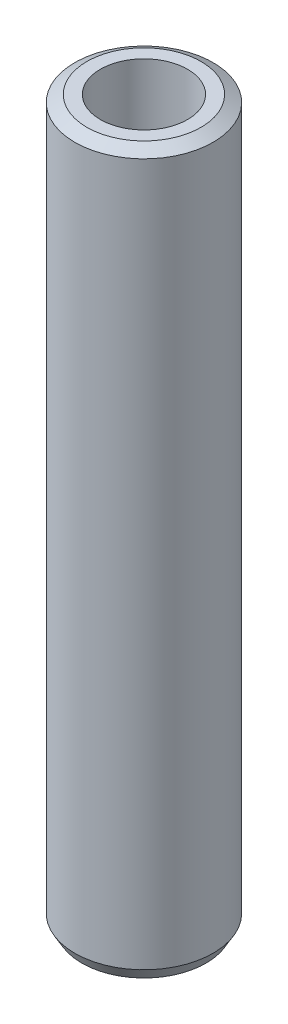
ISO-10303-21;
HEADER;
FILE_DESCRIPTION(('STEP AP214'),'2;1');
FILE_NAME('part.step','',(''),(''),'','','');
FILE_SCHEMA(('AUTOMOTIVE_DESIGN { 1 0 10303 214 1 1 1 1 }'));
ENDSEC;
DATA;
#1=APPLICATION_CONTEXT('core data for automotive mechanical design processes');
#2=APPLICATION_PROTOCOL_DEFINITION('international standard','automotive_design',2000,#1);
#3=PRODUCT_CONTEXT('',#1,'mechanical');
#4=PRODUCT('Part','Part','',(#3));
#5=PRODUCT_RELATED_PRODUCT_CATEGORY('part','',(#4));
#6=PRODUCT_DEFINITION_FORMATION('','',#4);
#7=PRODUCT_DEFINITION_CONTEXT('part definition',#1,'design');
#8=PRODUCT_DEFINITION('design','',#6,#7);
#9=PRODUCT_DEFINITION_SHAPE('','',#8);
#10=(LENGTH_UNIT() NAMED_UNIT(*) SI_UNIT(.MILLI.,.METRE.));
#11=(NAMED_UNIT(*) PLANE_ANGLE_UNIT() SI_UNIT($,.RADIAN.));
#12=(NAMED_UNIT(*) SI_UNIT($,.STERADIAN.) SOLID_ANGLE_UNIT());
#13=UNCERTAINTY_MEASURE_WITH_UNIT(LENGTH_MEASURE(1.E-05),#10,'distance_accuracy_value','');
#14=(GEOMETRIC_REPRESENTATION_CONTEXT(3) GLOBAL_UNCERTAINTY_ASSIGNED_CONTEXT((#13)) GLOBAL_UNIT_ASSIGNED_CONTEXT((#10,
#11,#12)) REPRESENTATION_CONTEXT('',''));
#15=CARTESIAN_POINT('',(0.,0.,0.));
#16=DIRECTION('',(0.,0.,1.));
#17=DIRECTION('',(1.,0.,0.));
#18=AXIS2_PLACEMENT_3D('',#15,#16,#17);
#19=CARTESIAN_POINT('',(0.,600.,0.));
#20=DIRECTION('',(0.,-1.,0.));
#21=DIRECTION('',(0.,0.,-1.));
#22=AXIS2_PLACEMENT_3D('',#19,#20,#21);
#23=CYLINDRICAL_SURFACE('',#22,57.5);
#24=CARTESIAN_POINT('',(0.,594.209642414054,0.));
#25=DIRECTION('',(0.,1.,0.));
#26=DIRECTION('',(0.,0.,1.));
#27=AXIS2_PLACEMENT_3D('',#24,#25,#26);
#28=CIRCLE('',#27,57.5);
#29=CARTESIAN_POINT('',(0.,594.209642414054,57.5));
#30=VERTEX_POINT('',#29);
#31=EDGE_CURVE('E50',#30,#30,#28,.F.);
#32=ORIENTED_EDGE('',*,*,#31,.T.);
#33=EDGE_LOOP('',(#32));
#34=FACE_BOUND('',#33,.T.);
#35=CARTESIAN_POINT('',(0.,10.0291935328497,0.));
#36=DIRECTION('',(0.,1.,0.));
#37=DIRECTION('',(0.,0.,1.));
#38=AXIS2_PLACEMENT_3D('',#35,#36,#37);
#39=CIRCLE('',#38,57.5);
#40=CARTESIAN_POINT('',(0.,10.0291935328497,57.5));
#41=VERTEX_POINT('',#40);
#42=EDGE_CURVE('E51',#41,#41,#39,.T.);
#43=ORIENTED_EDGE('',*,*,#42,.T.);
#44=EDGE_LOOP('',(#43));
#45=FACE_BOUND('',#44,.T.);
#46=ADVANCED_FACE('F39',(#34,#45),#23,.T.);
#47=CARTESIAN_POINT('',(0.,600.,0.));
#48=DIRECTION('',(0.,1.,0.));
#49=DIRECTION('',(0.,0.,1.));
#50=AXIS2_PLACEMENT_3D('',#47,#48,#49);
#51=PLANE('',#50);
#52=CARTESIAN_POINT('',(0.,600.,0.));
#53=DIRECTION('',(0.,1.,0.));
#54=DIRECTION('',(0.,0.,1.));
#55=AXIS2_PLACEMENT_3D('',#52,#53,#54);
#56=CIRCLE('',#55,47.4708064671501);
#57=CARTESIAN_POINT('',(0.,600.,47.4708064671501));
#58=VERTEX_POINT('',#57);
#59=EDGE_CURVE('E54',#58,#58,#56,.T.);
#60=ORIENTED_EDGE('',*,*,#59,.T.);
#61=EDGE_LOOP('',(#60));
#62=FACE_BOUND('',#61,.T.);
#63=CARTESIAN_POINT('',(0.,600.,0.));
#64=DIRECTION('',(0.,1.,0.));
#65=DIRECTION('',(0.,0.,1.));
#66=AXIS2_PLACEMENT_3D('',#63,#64,#65);
#67=CIRCLE('',#66,36.2742283481444);
#68=CARTESIAN_POINT('',(0.,600.,36.2742283481444));
#69=VERTEX_POINT('',#68);
#70=EDGE_CURVE('E58',#69,#69,#67,.T.);
#71=ORIENTED_EDGE('',*,*,#70,.F.);
#72=EDGE_LOOP('',(#71));
#73=FACE_BOUND('',#72,.T.);
#74=ADVANCED_FACE('F69',(#62,#73),#51,.T.);
#75=CARTESIAN_POINT('',(0.,0.,0.));
#76=DIRECTION('',(0.,1.,0.));
#77=DIRECTION('',(0.,0.,1.));
#78=AXIS2_PLACEMENT_3D('',#75,#76,#77);
#79=PLANE('',#78);
#80=CARTESIAN_POINT('',(0.,0.,0.));
#81=DIRECTION('',(0.,1.,0.));
#82=DIRECTION('',(0.,0.,1.));
#83=AXIS2_PLACEMENT_3D('',#80,#81,#82);
#84=CIRCLE('',#83,51.7096424140543);
#85=CARTESIAN_POINT('',(0.,0.,51.7096424140543));
#86=VERTEX_POINT('',#85);
#87=EDGE_CURVE('E10',#86,#86,#84,.F.);
#88=ORIENTED_EDGE('',*,*,#87,.T.);
#89=EDGE_LOOP('',(#88));
#90=FACE_BOUND('',#89,.T.);
#91=CARTESIAN_POINT('',(0.,0.,0.));
#92=DIRECTION('',(0.,1.,0.));
#93=DIRECTION('',(0.,0.,1.));
#94=AXIS2_PLACEMENT_3D('',#91,#92,#93);
#95=CIRCLE('',#94,36.2742283481444);
#96=CARTESIAN_POINT('',(0.,0.,36.2742283481444));
#97=VERTEX_POINT('',#96);
#98=EDGE_CURVE('E63',#97,#97,#95,.T.);
#99=ORIENTED_EDGE('',*,*,#98,.T.);
#100=EDGE_LOOP('',(#99));
#101=FACE_BOUND('',#100,.T.);
#102=ADVANCED_FACE('F75',(#90,#101),#79,.F.);
#103=CARTESIAN_POINT('',(0.,600.,0.));
#104=DIRECTION('',(0.,-1.,0.));
#105=DIRECTION('',(0.,0.,-1.));
#106=AXIS2_PLACEMENT_3D('',#103,#104,#105);
#107=CYLINDRICAL_SURFACE('',#106,36.2742283481444);
#108=ORIENTED_EDGE('',*,*,#70,.T.);
#109=EDGE_LOOP('',(#108));
#110=FACE_BOUND('',#109,.T.);
#111=ORIENTED_EDGE('',*,*,#98,.F.);
#112=EDGE_LOOP('',(#111));
#113=FACE_BOUND('',#112,.T.);
#114=ADVANCED_FACE('F70',(#110,#113),#107,.F.);
#115=CARTESIAN_POINT('',(0.,600.,0.));
#116=DIRECTION('',(0.,-1.,0.));
#117=DIRECTION('',(0.,0.,-1.));
#118=AXIS2_PLACEMENT_3D('',#115,#116,#117);
#119=CONICAL_SURFACE('',#118,47.4708064671501,1.04719755119659);
#120=ORIENTED_EDGE('',*,*,#31,.F.);
#121=EDGE_LOOP('',(#120));
#122=FACE_BOUND('',#121,.T.);
#123=ORIENTED_EDGE('',*,*,#59,.F.);
#124=EDGE_LOOP('',(#123));
#125=FACE_BOUND('',#124,.T.);
#126=ADVANCED_FACE('F81',(#122,#125),#119,.T.);
#127=CARTESIAN_POINT('',(0.,10.0291935328497,0.));
#128=DIRECTION('',(0.,1.,0.));
#129=DIRECTION('',(0.,0.,1.));
#130=AXIS2_PLACEMENT_3D('',#127,#128,#129);
#131=CONICAL_SURFACE('',#130,57.5,0.523598775598301);
#132=CARTESIAN_POINT('',(0.,0.,51.7096424140543));
#133=CARTESIAN_POINT('',(0.,0.104470765967184,51.7699586389079));
#134=CARTESIAN_POINT('',(0.,0.208941531934368,51.8302748637615));
#135=CARTESIAN_POINT('',(0.,0.417883063868736,51.9509073134687));
#136=CARTESIAN_POINT('',(0.,0.52235382983592,52.0112235383223));
#137=CARTESIAN_POINT('',(0.,0.731295361770289,52.1318559880295));
#138=CARTESIAN_POINT('',(0.,0.835766127737473,52.1921722128832));
#139=CARTESIAN_POINT('',(0.,1.04470765967184,52.3128046625903));
#140=CARTESIAN_POINT('',(0.,1.14917842563903,52.373120887444));
#141=CARTESIAN_POINT('',(0.,1.3581199575734,52.4937533371512));
#142=CARTESIAN_POINT('',(0.,1.46259072354058,52.5540695620048));
#143=CARTESIAN_POINT('',(0.,1.67153225547495,52.674702011712));
#144=CARTESIAN_POINT('',(0.,1.77600302144213,52.7350182365656));
#145=CARTESIAN_POINT('',(0.,1.9849445533765,52.8556506862728));
#146=CARTESIAN_POINT('',(0.,2.08941531934369,52.9159669111264));
#147=CARTESIAN_POINT('',(0.,2.29835685127805,53.0365993608336));
#148=CARTESIAN_POINT('',(0.,2.40282761724524,53.0969155856872));
#149=CARTESIAN_POINT('',(0.,2.61176914917961,53.2175480353944));
#150=CARTESIAN_POINT('',(0.,2.71623991514679,53.277864260248));
#151=CARTESIAN_POINT('',(0.,2.92518144708116,53.3984967099552));
#152=CARTESIAN_POINT('',(0.,3.02965221304834,53.4588129348088));
#153=CARTESIAN_POINT('',(0.,3.23859374498271,53.579445384516));
#154=CARTESIAN_POINT('',(0.,3.3430645109499,53.6397616093696));
#155=CARTESIAN_POINT('',(0.,3.55200604288427,53.7603940590768));
#156=CARTESIAN_POINT('',(0.,3.65647680885145,53.8207102839304));
#157=CARTESIAN_POINT('',(0.,3.86541834078582,53.9413427336376));
#158=CARTESIAN_POINT('',(0.,3.96988910675301,54.0016589584912));
#159=CARTESIAN_POINT('',(0.,4.17883063868737,54.1222914081984));
#160=CARTESIAN_POINT('',(0.,4.28330140465456,54.182607633052));
#161=CARTESIAN_POINT('',(0.,4.49224293658893,54.3032400827592));
#162=CARTESIAN_POINT('',(0.,4.59671370255611,54.3635563076128));
#163=CARTESIAN_POINT('',(0.,4.80565523449048,54.48418875732));
#164=CARTESIAN_POINT('',(0.,4.91012600045767,54.5445049821736));
#165=CARTESIAN_POINT('',(0.,5.11906753239203,54.6651374318808));
#166=CARTESIAN_POINT('',(0.,5.22353829835922,54.7254536567344));
#167=CARTESIAN_POINT('',(0.,5.43247983029359,54.8460861064416));
#168=CARTESIAN_POINT('',(0.,5.53695059626077,54.9064023312952));
#169=CARTESIAN_POINT('',(0.,5.74589212819514,55.0270347810024));
#170=CARTESIAN_POINT('',(0.,5.85036289416232,55.087351005856));
#171=CARTESIAN_POINT('',(0.,6.05930442609669,55.2079834555632));
#172=CARTESIAN_POINT('',(0.,6.16377519206388,55.2682996804168));
#173=CARTESIAN_POINT('',(0.,6.37271672399825,55.388932130124));
#174=CARTESIAN_POINT('',(0.,6.47718748996543,55.4492483549776));
#175=CARTESIAN_POINT('',(0.,6.6861290218998,55.5698808046848));
#176=CARTESIAN_POINT('',(0.,6.79059978786698,55.6301970295384));
#177=CARTESIAN_POINT('',(0.,6.99954131980135,55.7508294792456));
#178=CARTESIAN_POINT('',(0.,7.10401208576854,55.8111457040992));
#179=CARTESIAN_POINT('',(0.,7.31295361770291,55.9317781538064));
#180=CARTESIAN_POINT('',(0.,7.41742438367009,55.99209437866));
#181=CARTESIAN_POINT('',(0.,7.62636591560446,56.1127268283672));
#182=CARTESIAN_POINT('',(0.,7.73083668157164,56.1730430532208));
#183=CARTESIAN_POINT('',(0.,7.93977821350601,56.293675502928));
#184=CARTESIAN_POINT('',(0.,8.0442489794732,56.3539917277816));
#185=CARTESIAN_POINT('',(0.,8.25319051140757,56.4746241774888));
#186=CARTESIAN_POINT('',(0.,8.35766127737475,56.5349404023424));
#187=CARTESIAN_POINT('',(0.,8.56660280930912,56.6555728520496));
#188=CARTESIAN_POINT('',(0.,8.6710735752763,56.7158890769032));
#189=CARTESIAN_POINT('',(0.,8.88001510721067,56.8365215266104));
#190=CARTESIAN_POINT('',(0.,8.98448587317786,56.896837751464));
#191=CARTESIAN_POINT('',(0.,9.19342740511223,57.0174702011712));
#192=CARTESIAN_POINT('',(0.,9.29789817107941,57.0777864260248));
#193=CARTESIAN_POINT('',(0.,9.50683970301378,57.198418875732));
#194=CARTESIAN_POINT('',(0.,9.61131046898096,57.2587351005856));
#195=CARTESIAN_POINT('',(0.,9.82025200091533,57.3793675502928));
#196=CARTESIAN_POINT('',(0.,9.92472276688252,57.4396837751464));
#197=CARTESIAN_POINT('',(0.,10.0291935328497,57.5));
#198=B_SPLINE_CURVE_WITH_KNOTS('',3,(#132,#133,#134,#135,#136,#137,#138,#139,#140,#141,#142,
#143,#144,#145,#146,#147,#148,#149,#150,#151,#152,#153,#154,#155,#156,#157,#158,#159,#160,#161,
#162,#163,#164,#165,#166,#167,#168,#169,#170,#171,#172,#173,#174,#175,#176,#177,#178,#179,#180,
#181,#182,#183,#184,#185,#186,#187,#188,#189,#190,#191,#192,#193,#194,#195,#196,#197),
.UNSPECIFIED.,.F.,.F.,(4,2,2,2,2,2,2,2,2,2,2,2,2,2,2,2,2,2,2,2,2,2,2,2,2,2,2,2,2,2,2,2,4),(0.,
0.361897349121599,0.723794698243202,1.08569204736481,1.44758939648641,1.80948674560801,
2.17138409472961,2.53328144385121,2.89517879297282,3.25707614209442,3.61897349121602,
3.98087084033762,4.34276818945923,4.70466553858083,5.06656288770243,5.42846023682404,
5.79035758594564,6.15225493506724,6.51415228418884,6.87604963331044,7.23794698243205,
7.59984433155365,7.96174168067525,8.32363902979685,8.68553637891846,9.04743372804006,
9.40933107716166,9.77122842628326,10.1331257754049,10.4950231245265,10.8569204736481,
11.2188178227697,11.5807151718913),.UNSPECIFIED.);
#199=EDGE_CURVE('BSEAM45',#86,#41,#198,.T.);
#200=ORIENTED_EDGE('',*,*,#87,.F.);
#201=ORIENTED_EDGE('',*,*,#42,.F.);
#202=ORIENTED_EDGE('',*,*,#199,.T.);
#203=ORIENTED_EDGE('',*,*,#199,.F.);
#204=EDGE_LOOP('',(#200,#202,#201,#203));
#205=FACE_BOUND('',#204,.T.);
#206=ADVANCED_FACE('F45',(#205),#131,.T.);
#207=CLOSED_SHELL('',(#46,#74,#102,#114,#126,#206));
#208=MANIFOLD_SOLID_BREP('B2',#207);
#209=ADVANCED_BREP_SHAPE_REPRESENTATION('',(#18,#208),#14);
#210=SHAPE_DEFINITION_REPRESENTATION(#9,#209);
ENDSEC;
END-ISO-10303-21;
